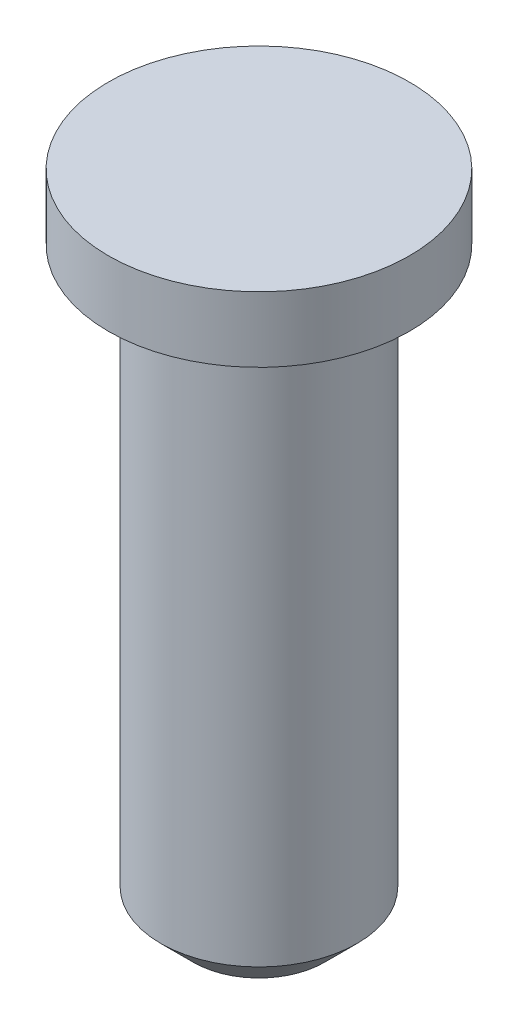
ISO-10303-21;
HEADER;
FILE_DESCRIPTION(('STEP AP214'),'2;1');
FILE_NAME('part.step','',(''),(''),'','','');
FILE_SCHEMA(('AUTOMOTIVE_DESIGN { 1 0 10303 214 1 1 1 1 }'));
ENDSEC;
DATA;
#1=APPLICATION_CONTEXT('core data for automotive mechanical design processes');
#2=APPLICATION_PROTOCOL_DEFINITION('international standard','automotive_design',2000,#1);
#3=PRODUCT_CONTEXT('',#1,'mechanical');
#4=PRODUCT('Part','Part','',(#3));
#5=PRODUCT_RELATED_PRODUCT_CATEGORY('part','',(#4));
#6=PRODUCT_DEFINITION_FORMATION('','',#4);
#7=PRODUCT_DEFINITION_CONTEXT('part definition',#1,'design');
#8=PRODUCT_DEFINITION('design','',#6,#7);
#9=PRODUCT_DEFINITION_SHAPE('','',#8);
#10=(LENGTH_UNIT() NAMED_UNIT(*) SI_UNIT(.MILLI.,.METRE.));
#11=(NAMED_UNIT(*) PLANE_ANGLE_UNIT() SI_UNIT($,.RADIAN.));
#12=(NAMED_UNIT(*) SI_UNIT($,.STERADIAN.) SOLID_ANGLE_UNIT());
#13=UNCERTAINTY_MEASURE_WITH_UNIT(LENGTH_MEASURE(1.E-05),#10,'distance_accuracy_value','');
#14=(GEOMETRIC_REPRESENTATION_CONTEXT(3) GLOBAL_UNCERTAINTY_ASSIGNED_CONTEXT((#13)) GLOBAL_UNIT_ASSIGNED_CONTEXT((#10,
#11,#12)) REPRESENTATION_CONTEXT('',''));
#15=CARTESIAN_POINT('',(0.,0.,0.));
#16=DIRECTION('',(0.,0.,1.));
#17=DIRECTION('',(1.,0.,0.));
#18=AXIS2_PLACEMENT_3D('',#15,#16,#17);
#19=CARTESIAN_POINT('',(0.,0.,0.));
#20=DIRECTION('',(0.,-1.,0.));
#21=DIRECTION('',(0.,0.,-1.));
#22=AXIS2_PLACEMENT_3D('',#19,#20,#21);
#23=PLANE('',#22);
#24=CARTESIAN_POINT('',(0.,0.,0.));
#25=DIRECTION('',(0.,1.,0.));
#26=DIRECTION('',(0.,0.,1.));
#27=AXIS2_PLACEMENT_3D('',#24,#25,#26);
#28=CIRCLE('',#27,2.3);
#29=CARTESIAN_POINT('',(0.,0.,2.3));
#30=VERTEX_POINT('',#29);
#31=EDGE_CURVE('E43',#30,#30,#28,.T.);
#32=ORIENTED_EDGE('',*,*,#31,.T.);
#33=EDGE_LOOP('',(#32));
#34=FACE_BOUND('',#33,.T.);
#35=ADVANCED_FACE('F32',(#34),#23,.F.);
#36=CARTESIAN_POINT('',(0.,0.,0.));
#37=DIRECTION('',(0.,1.,0.));
#38=DIRECTION('',(0.,0.,1.));
#39=AXIS2_PLACEMENT_3D('',#36,#37,#38);
#40=CYLINDRICAL_SURFACE('',#39,2.3);
#41=ORIENTED_EDGE('',*,*,#31,.F.);
#42=EDGE_LOOP('',(#41));
#43=FACE_BOUND('',#42,.T.);
#44=CARTESIAN_POINT('',(0.,-1.,0.));
#45=DIRECTION('',(0.,1.,0.));
#46=DIRECTION('',(0.,0.,1.));
#47=AXIS2_PLACEMENT_3D('',#44,#45,#46);
#48=CIRCLE('',#47,2.3);
#49=CARTESIAN_POINT('',(0.,-1.,2.3));
#50=VERTEX_POINT('',#49);
#51=EDGE_CURVE('E47',#50,#50,#48,.T.);
#52=ORIENTED_EDGE('',*,*,#51,.T.);
#53=EDGE_LOOP('',(#52));
#54=FACE_BOUND('',#53,.T.);
#55=ADVANCED_FACE('F67',(#43,#54),#40,.T.);
#56=CARTESIAN_POINT('',(2.3,-1.,0.));
#57=DIRECTION('',(0.,1.,0.));
#58=DIRECTION('',(0.,0.,1.));
#59=AXIS2_PLACEMENT_3D('',#56,#57,#58);
#60=PLANE('',#59);
#61=ORIENTED_EDGE('',*,*,#51,.F.);
#62=EDGE_LOOP('',(#61));
#63=FACE_BOUND('',#62,.T.);
#64=CARTESIAN_POINT('',(0.,-1.,0.));
#65=DIRECTION('',(0.,1.,0.));
#66=DIRECTION('',(0.,0.,1.));
#67=AXIS2_PLACEMENT_3D('',#64,#65,#66);
#68=CIRCLE('',#67,1.5);
#69=CARTESIAN_POINT('',(0.,-1.,1.5));
#70=VERTEX_POINT('',#69);
#71=EDGE_CURVE('E52',#70,#70,#68,.T.);
#72=ORIENTED_EDGE('',*,*,#71,.T.);
#73=EDGE_LOOP('',(#72));
#74=FACE_BOUND('',#73,.T.);
#75=ADVANCED_FACE('F56',(#63,#74),#60,.F.);
#76=CARTESIAN_POINT('',(0.,0.,0.));
#77=DIRECTION('',(0.,1.,0.));
#78=DIRECTION('',(0.,0.,1.));
#79=AXIS2_PLACEMENT_3D('',#76,#77,#78);
#80=CYLINDRICAL_SURFACE('',#79,1.5);
#81=CARTESIAN_POINT('',(0.,-9.5,0.));
#82=DIRECTION('',(0.,1.,0.));
#83=DIRECTION('',(0.,0.,1.));
#84=AXIS2_PLACEMENT_3D('',#81,#82,#83);
#85=CIRCLE('',#84,1.5);
#86=CARTESIAN_POINT('',(0.,-9.5,1.5));
#87=VERTEX_POINT('',#86);
#88=EDGE_CURVE('E39',#87,#87,#85,.T.);
#89=ORIENTED_EDGE('',*,*,#88,.T.);
#90=EDGE_LOOP('',(#89));
#91=FACE_BOUND('',#90,.T.);
#92=ORIENTED_EDGE('',*,*,#71,.F.);
#93=EDGE_LOOP('',(#92));
#94=FACE_BOUND('',#93,.T.);
#95=ADVANCED_FACE('F58',(#91,#94),#80,.T.);
#96=CARTESIAN_POINT('',(1.5,-10.,0.));
#97=DIRECTION('',(0.,1.,0.));
#98=DIRECTION('',(0.,0.,1.));
#99=AXIS2_PLACEMENT_3D('',#96,#97,#98);
#100=PLANE('',#99);
#101=CARTESIAN_POINT('',(0.,-10.,0.));
#102=DIRECTION('',(0.,1.,0.));
#103=DIRECTION('',(0.,0.,1.));
#104=AXIS2_PLACEMENT_3D('',#101,#102,#103);
#105=CIRCLE('',#104,1.);
#106=CARTESIAN_POINT('',(0.,-10.,1.));
#107=VERTEX_POINT('',#106);
#108=EDGE_CURVE('E10',#107,#107,#105,.F.);
#109=ORIENTED_EDGE('',*,*,#108,.T.);
#110=EDGE_LOOP('',(#109));
#111=FACE_BOUND('',#110,.T.);
#112=ADVANCED_FACE('F60',(#111),#100,.F.);
#113=CARTESIAN_POINT('',(0.,-9.5,0.));
#114=DIRECTION('',(0.,1.,0.));
#115=DIRECTION('',(0.,0.,1.));
#116=AXIS2_PLACEMENT_3D('',#113,#114,#115);
#117=CONICAL_SURFACE('',#116,1.5,0.785398163397449);
#118=ORIENTED_EDGE('',*,*,#108,.F.);
#119=EDGE_LOOP('',(#118));
#120=FACE_BOUND('',#119,.T.);
#121=ORIENTED_EDGE('',*,*,#88,.F.);
#122=EDGE_LOOP('',(#121));
#123=FACE_BOUND('',#122,.T.);
#124=ADVANCED_FACE('F34',(#120,#123),#117,.T.);
#125=CLOSED_SHELL('',(#35,#55,#75,#95,#112,#124));
#126=MANIFOLD_SOLID_BREP('B2',#125);
#127=ADVANCED_BREP_SHAPE_REPRESENTATION('',(#18,#126),#14);
#128=SHAPE_DEFINITION_REPRESENTATION(#9,#127);
ENDSEC;
END-ISO-10303-21;
